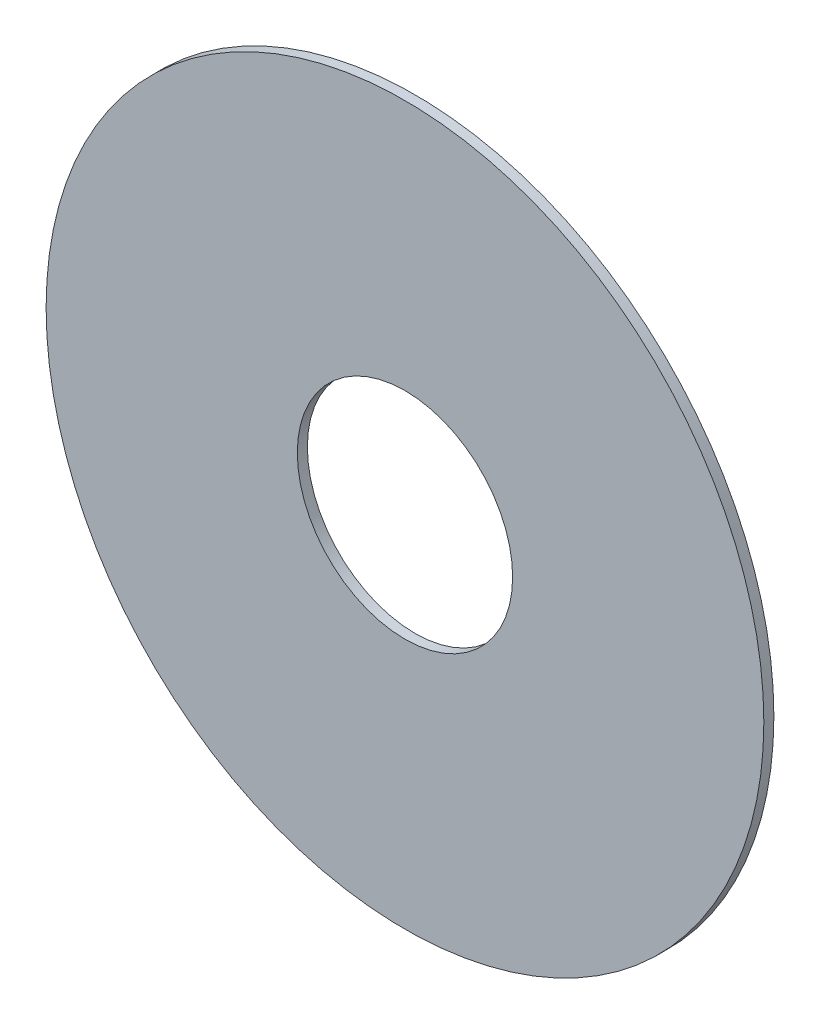
ISO-10303-21;
HEADER;
FILE_DESCRIPTION(('STEP AP214'),'2;1');
FILE_NAME('part.step','',(''),(''),'','','');
FILE_SCHEMA(('AUTOMOTIVE_DESIGN { 1 0 10303 214 1 1 1 1 }'));
ENDSEC;
DATA;
#1=APPLICATION_CONTEXT('core data for automotive mechanical design processes');
#2=APPLICATION_PROTOCOL_DEFINITION('international standard','automotive_design',2000,#1);
#3=PRODUCT_CONTEXT('',#1,'mechanical');
#4=PRODUCT('Part','Part','',(#3));
#5=PRODUCT_RELATED_PRODUCT_CATEGORY('part','',(#4));
#6=PRODUCT_DEFINITION_FORMATION('','',#4);
#7=PRODUCT_DEFINITION_CONTEXT('part definition',#1,'design');
#8=PRODUCT_DEFINITION('design','',#6,#7);
#9=PRODUCT_DEFINITION_SHAPE('','',#8);
#10=(LENGTH_UNIT() NAMED_UNIT(*) SI_UNIT(.MILLI.,.METRE.));
#11=(NAMED_UNIT(*) PLANE_ANGLE_UNIT() SI_UNIT($,.RADIAN.));
#12=(NAMED_UNIT(*) SI_UNIT($,.STERADIAN.) SOLID_ANGLE_UNIT());
#13=UNCERTAINTY_MEASURE_WITH_UNIT(LENGTH_MEASURE(1.E-05),#10,'distance_accuracy_value','');
#14=(GEOMETRIC_REPRESENTATION_CONTEXT(3) GLOBAL_UNCERTAINTY_ASSIGNED_CONTEXT((#13)) GLOBAL_UNIT_ASSIGNED_CONTEXT((#10,
#11,#12)) REPRESENTATION_CONTEXT('',''));
#15=CARTESIAN_POINT('',(0.,0.,0.));
#16=DIRECTION('',(0.,0.,1.));
#17=DIRECTION('',(1.,0.,0.));
#18=AXIS2_PLACEMENT_3D('',#15,#16,#17);
#19=CARTESIAN_POINT('',(176.276,-105.664,-0.045));
#20=DIRECTION('',(0.,0.,-1.));
#21=DIRECTION('',(0.,-1.,0.));
#22=AXIS2_PLACEMENT_3D('',#19,#20,#21);
#23=CYLINDRICAL_SURFACE('',#22,0.375);
#24=CARTESIAN_POINT('',(176.276,-105.664,-0.035));
#25=DIRECTION('',(0.,0.,-1.));
#26=DIRECTION('',(0.,-1.,0.));
#27=AXIS2_PLACEMENT_3D('',#24,#25,#26);
#28=CIRCLE('',#27,0.375);
#29=CARTESIAN_POINT('',(176.276,-106.039,-0.035));
#30=VERTEX_POINT('',#29);
#31=EDGE_CURVE('E20',#30,#30,#28,.T.);
#32=ORIENTED_EDGE('',*,*,#31,.T.);
#33=DIRECTION('',(0.,0.,1.));
#34=VECTOR('',#33,1.);
#35=CARTESIAN_POINT('',(176.276,-106.039,-0.045));
#36=LINE('',#35,#34);
#37=CARTESIAN_POINT('',(176.276,-106.039,0.));
#38=VERTEX_POINT('',#37);
#39=EDGE_CURVE('E11',#30,#38,#36,.T.);
#40=ORIENTED_EDGE('',*,*,#39,.T.);
#41=CARTESIAN_POINT('',(176.276,-105.664,0.));
#42=DIRECTION('',(0.,0.,-1.));
#43=DIRECTION('',(0.,-1.,0.));
#44=AXIS2_PLACEMENT_3D('',#41,#42,#43);
#45=CIRCLE('',#44,0.375);
#46=EDGE_CURVE('E69',#38,#38,#45,.T.);
#47=ORIENTED_EDGE('',*,*,#46,.F.);
#48=ORIENTED_EDGE('',*,*,#39,.F.);
#49=EDGE_LOOP('',(#32,#40,#47,#48));
#50=FACE_BOUND('',#49,.T.);
#51=ADVANCED_FACE('F17',(#50),#23,.F.);
#52=CARTESIAN_POINT('',(176.276,-105.664,-0.035));
#53=DIRECTION('',(0.,0.,1.));
#54=DIRECTION('',(1.,0.,0.));
#55=AXIS2_PLACEMENT_3D('',#52,#53,#54);
#56=PLANE('',#55);
#57=ORIENTED_EDGE('',*,*,#31,.F.);
#58=EDGE_LOOP('',(#57));
#59=FACE_BOUND('',#58,.T.);
#60=CARTESIAN_POINT('',(176.276,-105.664,-0.035));
#61=DIRECTION('',(0.,0.,1.));
#62=DIRECTION('',(1.,0.,0.));
#63=AXIS2_PLACEMENT_3D('',#60,#61,#62);
#64=CIRCLE('',#63,1.25);
#65=CARTESIAN_POINT('',(177.526,-105.664,-0.035));
#66=VERTEX_POINT('',#65);
#67=EDGE_CURVE('E57',#66,#66,#64,.T.);
#68=ORIENTED_EDGE('',*,*,#67,.F.);
#69=EDGE_LOOP('',(#68));
#70=FACE_BOUND('',#69,.T.);
#71=ADVANCED_FACE('F79',(#59,#70),#56,.F.);
#72=CARTESIAN_POINT('',(176.276,-105.664,0.));
#73=DIRECTION('',(0.,0.,1.));
#74=DIRECTION('',(1.,0.,0.));
#75=AXIS2_PLACEMENT_3D('',#72,#73,#74);
#76=PLANE('',#75);
#77=ORIENTED_EDGE('',*,*,#46,.T.);
#78=EDGE_LOOP('',(#77));
#79=FACE_BOUND('',#78,.T.);
#80=CARTESIAN_POINT('',(176.276,-105.664,0.));
#81=DIRECTION('',(0.,0.,1.));
#82=DIRECTION('',(1.,0.,0.));
#83=AXIS2_PLACEMENT_3D('',#80,#81,#82);
#84=CIRCLE('',#83,1.25);
#85=CARTESIAN_POINT('',(177.526,-105.664,0.));
#86=VERTEX_POINT('',#85);
#87=EDGE_CURVE('E55',#86,#86,#84,.T.);
#88=ORIENTED_EDGE('',*,*,#87,.T.);
#89=EDGE_LOOP('',(#88));
#90=FACE_BOUND('',#89,.T.);
#91=ADVANCED_FACE('F61',(#79,#90),#76,.T.);
#92=CARTESIAN_POINT('',(176.276,-105.664,-0.035));
#93=DIRECTION('',(0.,0.,1.));
#94=DIRECTION('',(1.,0.,0.));
#95=AXIS2_PLACEMENT_3D('',#92,#93,#94);
#96=CYLINDRICAL_SURFACE('',#95,1.25);
#97=ORIENTED_EDGE('',*,*,#87,.F.);
#98=DIRECTION('',(0.,0.,1.));
#99=VECTOR('',#98,1.);
#100=CARTESIAN_POINT('',(177.526,-105.664,-0.035));
#101=LINE('',#100,#99);
#102=EDGE_CURVE('E52',#66,#86,#101,.T.);
#103=ORIENTED_EDGE('',*,*,#102,.F.);
#104=ORIENTED_EDGE('',*,*,#67,.T.);
#105=ORIENTED_EDGE('',*,*,#102,.T.);
#106=EDGE_LOOP('',(#97,#103,#104,#105));
#107=FACE_BOUND('',#106,.T.);
#108=ADVANCED_FACE('F54',(#107),#96,.T.);
#109=CLOSED_SHELL('',(#51,#71,#91,#108));
#110=MANIFOLD_SOLID_BREP('B1',#109);
#111=ADVANCED_BREP_SHAPE_REPRESENTATION('',(#18,#110),#14);
#112=SHAPE_DEFINITION_REPRESENTATION(#9,#111);
ENDSEC;
END-ISO-10303-21;
